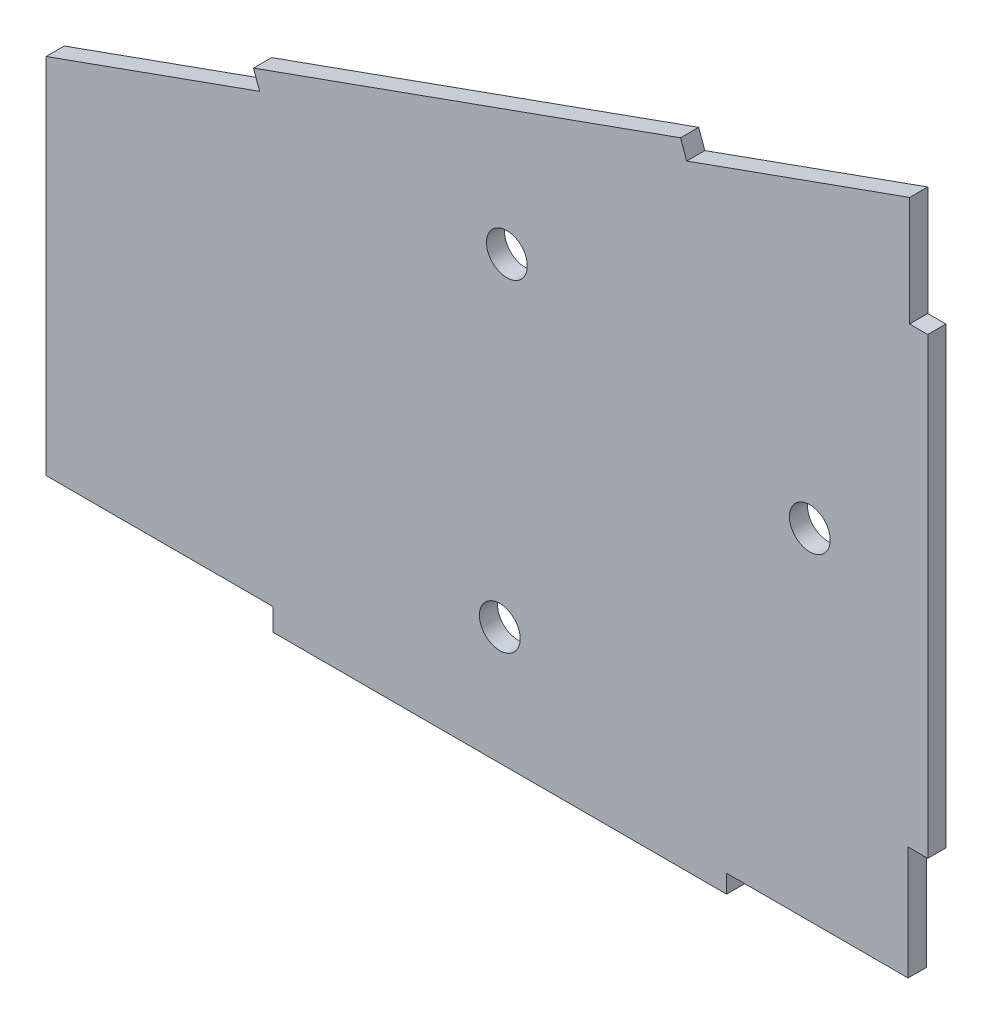
ISO-10303-21;
HEADER;
FILE_DESCRIPTION(('STEP AP214'),'2;1');
FILE_NAME('part.step','',(''),(''),'','','');
FILE_SCHEMA(('AUTOMOTIVE_DESIGN { 1 0 10303 214 1 1 1 1 }'));
ENDSEC;
DATA;
#1=APPLICATION_CONTEXT('core data for automotive mechanical design processes');
#2=APPLICATION_PROTOCOL_DEFINITION('international standard','automotive_design',2000,#1);
#3=PRODUCT_CONTEXT('',#1,'mechanical');
#4=PRODUCT('Part','Part','',(#3));
#5=PRODUCT_RELATED_PRODUCT_CATEGORY('part','',(#4));
#6=PRODUCT_DEFINITION_FORMATION('','',#4);
#7=PRODUCT_DEFINITION_CONTEXT('part definition',#1,'design');
#8=PRODUCT_DEFINITION('design','',#6,#7);
#9=PRODUCT_DEFINITION_SHAPE('','',#8);
#10=(LENGTH_UNIT() NAMED_UNIT(*) SI_UNIT(.MILLI.,.METRE.));
#11=(NAMED_UNIT(*) PLANE_ANGLE_UNIT() SI_UNIT($,.RADIAN.));
#12=(NAMED_UNIT(*) SI_UNIT($,.STERADIAN.) SOLID_ANGLE_UNIT());
#13=UNCERTAINTY_MEASURE_WITH_UNIT(LENGTH_MEASURE(1.E-05),#10,'distance_accuracy_value','');
#14=(GEOMETRIC_REPRESENTATION_CONTEXT(3) GLOBAL_UNCERTAINTY_ASSIGNED_CONTEXT((#13)) GLOBAL_UNIT_ASSIGNED_CONTEXT((#10,
#11,#12)) REPRESENTATION_CONTEXT('',''));
#15=CARTESIAN_POINT('',(0.,0.,0.));
#16=DIRECTION('',(0.,0.,1.));
#17=DIRECTION('',(1.,0.,0.));
#18=AXIS2_PLACEMENT_3D('',#15,#16,#17);
#19=CARTESIAN_POINT('',(-41.4083095907315,11.0698668127962,2.));
#20=DIRECTION('',(0.3375865479723,-0.94129449304038,0.));
#21=DIRECTION('',(0.94129449304038,0.3375865479723,0.));
#22=AXIS2_PLACEMENT_3D('',#19,#20,#21);
#23=PLANE('',#22);
#24=DIRECTION('',(-0.94129449304038,-0.3375865479723,0.));
#25=VECTOR('',#24,1.);
#26=CARTESIAN_POINT('',(-41.4083095907315,11.0698668127962,0.));
#27=LINE('',#26,#25);
#28=CARTESIAN_POINT('',(-41.4083095907315,11.0698668127962,0.));
#29=VERTEX_POINT('',#28);
#30=CARTESIAN_POINT('',(-64.9406719167412,2.63020311348861,0.));
#31=VERTEX_POINT('',#30);
#32=EDGE_CURVE('E190',#29,#31,#27,.T.);
#33=ORIENTED_EDGE('',*,*,#32,.T.);
#34=DIRECTION('',(0.,0.,-1.));
#35=VECTOR('',#34,1.);
#36=CARTESIAN_POINT('',(-64.9406719167412,2.63020311348861,2.));
#37=LINE('',#36,#35);
#38=CARTESIAN_POINT('',(-64.9406719167412,2.63020311348861,2.));
#39=VERTEX_POINT('',#38);
#40=EDGE_CURVE('E11',#39,#31,#37,.T.);
#41=ORIENTED_EDGE('',*,*,#40,.F.);
#42=DIRECTION('',(-0.94129449304038,-0.3375865479723,0.));
#43=VECTOR('',#42,1.);
#44=CARTESIAN_POINT('',(-41.4083095907315,11.0698668127962,2.));
#45=LINE('',#44,#43);
#46=CARTESIAN_POINT('',(-41.4083095907315,11.0698668127962,2.));
#47=VERTEX_POINT('',#46);
#48=EDGE_CURVE('E236',#47,#39,#45,.T.);
#49=ORIENTED_EDGE('',*,*,#48,.F.);
#50=DIRECTION('',(0.,0.,-1.));
#51=VECTOR('',#50,1.);
#52=CARTESIAN_POINT('',(-41.4083095907315,11.0698668127962,2.));
#53=LINE('',#52,#51);
#54=EDGE_CURVE('E186',#47,#29,#53,.T.);
#55=ORIENTED_EDGE('',*,*,#54,.T.);
#56=EDGE_LOOP('',(#33,#41,#49,#55));
#57=FACE_BOUND('',#56,.T.);
#58=ADVANCED_FACE('F39',(#57),#23,.F.);
#59=CARTESIAN_POINT('',(-64.9406719167412,2.63020311348861,2.));
#60=DIRECTION('',(1.,0.,0.));
#61=DIRECTION('',(0.,1.,0.));
#62=AXIS2_PLACEMENT_3D('',#59,#60,#61);
#63=PLANE('',#62);
#64=DIRECTION('',(0.,-1.,0.));
#65=VECTOR('',#64,1.);
#66=CARTESIAN_POINT('',(-64.9406719167412,2.63020311348861,0.));
#67=LINE('',#66,#65);
#68=CARTESIAN_POINT('',(-64.9406719167411,-37.3697968865117,0.));
#69=VERTEX_POINT('',#68);
#70=EDGE_CURVE('E194',#31,#69,#67,.T.);
#71=ORIENTED_EDGE('',*,*,#70,.T.);
#72=DIRECTION('',(0.,0.,-1.));
#73=VECTOR('',#72,1.);
#74=CARTESIAN_POINT('',(-64.9406719167411,-37.3697968865117,2.));
#75=LINE('',#74,#73);
#76=CARTESIAN_POINT('',(-64.9406719167411,-37.3697968865117,2.));
#77=VERTEX_POINT('',#76);
#78=EDGE_CURVE('E49',#77,#69,#75,.T.);
#79=ORIENTED_EDGE('',*,*,#78,.F.);
#80=DIRECTION('',(0.,-1.,0.));
#81=VECTOR('',#80,1.);
#82=CARTESIAN_POINT('',(-64.9406719167412,2.63020311348861,2.));
#83=LINE('',#82,#81);
#84=EDGE_CURVE('E125',#39,#77,#83,.T.);
#85=ORIENTED_EDGE('',*,*,#84,.F.);
#86=ORIENTED_EDGE('',*,*,#40,.T.);
#87=EDGE_LOOP('',(#71,#79,#85,#86));
#88=FACE_BOUND('',#87,.T.);
#89=ADVANCED_FACE('F381',(#88),#63,.F.);
#90=CARTESIAN_POINT('',(-64.9406719167411,-37.3697968865117,2.));
#91=DIRECTION('',(0.,1.,0.));
#92=DIRECTION('',(-1.,0.,0.));
#93=AXIS2_PLACEMENT_3D('',#90,#91,#92);
#94=PLANE('',#93);
#95=DIRECTION('',(1.,0.,0.));
#96=VECTOR('',#95,1.);
#97=CARTESIAN_POINT('',(-64.9406719167411,-37.3697968865117,0.));
#98=LINE('',#97,#96);
#99=CARTESIAN_POINT('',(-39.940671916741,-37.3697968865117,0.));
#100=VERTEX_POINT('',#99);
#101=EDGE_CURVE('E197',#69,#100,#98,.T.);
#102=ORIENTED_EDGE('',*,*,#101,.T.);
#103=DIRECTION('',(0.,0.,-1.));
#104=VECTOR('',#103,1.);
#105=CARTESIAN_POINT('',(-39.940671916741,-37.3697968865117,2.));
#106=LINE('',#105,#104);
#107=CARTESIAN_POINT('',(-39.940671916741,-37.3697968865117,2.));
#108=VERTEX_POINT('',#107);
#109=EDGE_CURVE('E279',#108,#100,#106,.T.);
#110=ORIENTED_EDGE('',*,*,#109,.F.);
#111=DIRECTION('',(1.,0.,0.));
#112=VECTOR('',#111,1.);
#113=CARTESIAN_POINT('',(-64.9406719167411,-37.3697968865117,2.));
#114=LINE('',#113,#112);
#115=EDGE_CURVE('E324',#77,#108,#114,.T.);
#116=ORIENTED_EDGE('',*,*,#115,.F.);
#117=ORIENTED_EDGE('',*,*,#78,.T.);
#118=EDGE_LOOP('',(#102,#110,#116,#117));
#119=FACE_BOUND('',#118,.T.);
#120=ADVANCED_FACE('F385',(#119),#94,.F.);
#121=CARTESIAN_POINT('',(-39.940671916741,-37.3697968865117,2.));
#122=DIRECTION('',(1.,0.,0.));
#123=DIRECTION('',(0.,1.,0.));
#124=AXIS2_PLACEMENT_3D('',#121,#122,#123);
#125=PLANE('',#124);
#126=DIRECTION('',(0.,-1.,0.));
#127=VECTOR('',#126,1.);
#128=CARTESIAN_POINT('',(-39.940671916741,-37.3697968865117,0.));
#129=LINE('',#128,#127);
#130=CARTESIAN_POINT('',(-39.940671916741,-39.8197968865117,0.));
#131=VERTEX_POINT('',#130);
#132=EDGE_CURVE('E200',#100,#131,#129,.T.);
#133=ORIENTED_EDGE('',*,*,#132,.T.);
#134=DIRECTION('',(0.,0.,-1.));
#135=VECTOR('',#134,1.);
#136=CARTESIAN_POINT('',(-39.940671916741,-39.8197968865117,2.));
#137=LINE('',#136,#135);
#138=CARTESIAN_POINT('',(-39.940671916741,-39.8197968865117,2.));
#139=VERTEX_POINT('',#138);
#140=EDGE_CURVE('E275',#139,#131,#137,.T.);
#141=ORIENTED_EDGE('',*,*,#140,.F.);
#142=DIRECTION('',(0.,-1.,0.));
#143=VECTOR('',#142,1.);
#144=CARTESIAN_POINT('',(-39.940671916741,-37.3697968865117,2.));
#145=LINE('',#144,#143);
#146=EDGE_CURVE('E327',#108,#139,#145,.T.);
#147=ORIENTED_EDGE('',*,*,#146,.F.);
#148=ORIENTED_EDGE('',*,*,#109,.T.);
#149=EDGE_LOOP('',(#133,#141,#147,#148));
#150=FACE_BOUND('',#149,.T.);
#151=ADVANCED_FACE('F389',(#150),#125,.F.);
#152=CARTESIAN_POINT('',(-39.940671916741,-39.8197968865117,2.));
#153=DIRECTION('',(0.,1.,0.));
#154=DIRECTION('',(0.,0.,1.));
#155=AXIS2_PLACEMENT_3D('',#152,#153,#154);
#156=PLANE('',#155);
#157=DIRECTION('',(1.,0.,0.));
#158=VECTOR('',#157,1.);
#159=CARTESIAN_POINT('',(-39.940671916741,-39.8197968865117,0.));
#160=LINE('',#159,#158);
#161=CARTESIAN_POINT('',(10.059328083259,-39.8197968865117,0.));
#162=VERTEX_POINT('',#161);
#163=EDGE_CURVE('E203',#131,#162,#160,.T.);
#164=ORIENTED_EDGE('',*,*,#163,.T.);
#165=DIRECTION('',(0.,0.,-1.));
#166=VECTOR('',#165,1.);
#167=CARTESIAN_POINT('',(10.059328083259,-39.8197968865117,2.));
#168=LINE('',#167,#166);
#169=CARTESIAN_POINT('',(10.059328083259,-39.8197968865117,2.));
#170=VERTEX_POINT('',#169);
#171=EDGE_CURVE('E271',#170,#162,#168,.T.);
#172=ORIENTED_EDGE('',*,*,#171,.F.);
#173=DIRECTION('',(1.,0.,0.));
#174=VECTOR('',#173,1.);
#175=CARTESIAN_POINT('',(-39.940671916741,-39.8197968865117,2.));
#176=LINE('',#175,#174);
#177=EDGE_CURVE('E330',#139,#170,#176,.T.);
#178=ORIENTED_EDGE('',*,*,#177,.F.);
#179=ORIENTED_EDGE('',*,*,#140,.T.);
#180=EDGE_LOOP('',(#164,#172,#178,#179));
#181=FACE_BOUND('',#180,.T.);
#182=ADVANCED_FACE('F395',(#181),#156,.F.);
#183=CARTESIAN_POINT('',(10.059328083259,-37.8197968865117,2.));
#184=DIRECTION('',(-1.,0.,0.));
#185=DIRECTION('',(0.,0.,1.));
#186=AXIS2_PLACEMENT_3D('',#183,#184,#185);
#187=PLANE('',#186);
#188=DIRECTION('',(0.,1.,0.));
#189=VECTOR('',#188,1.);
#190=CARTESIAN_POINT('',(10.059328083259,-37.8197968865117,0.));
#191=LINE('',#190,#189);
#192=CARTESIAN_POINT('',(10.059328083259,-37.8197968865117,0.));
#193=VERTEX_POINT('',#192);
#194=EDGE_CURVE('E206',#162,#193,#191,.T.);
#195=ORIENTED_EDGE('',*,*,#194,.T.);
#196=DIRECTION('',(0.,0.,-1.));
#197=VECTOR('',#196,1.);
#198=CARTESIAN_POINT('',(10.059328083259,-37.8197968865117,2.));
#199=LINE('',#198,#197);
#200=CARTESIAN_POINT('',(10.059328083259,-37.8197968865117,2.));
#201=VERTEX_POINT('',#200);
#202=EDGE_CURVE('E267',#201,#193,#199,.T.);
#203=ORIENTED_EDGE('',*,*,#202,.F.);
#204=DIRECTION('',(0.,1.,0.));
#205=VECTOR('',#204,1.);
#206=CARTESIAN_POINT('',(10.059328083259,-37.8197968865117,2.));
#207=LINE('',#206,#205);
#208=EDGE_CURVE('E333',#170,#201,#207,.T.);
#209=ORIENTED_EDGE('',*,*,#208,.F.);
#210=ORIENTED_EDGE('',*,*,#171,.T.);
#211=EDGE_LOOP('',(#195,#203,#209,#210));
#212=FACE_BOUND('',#211,.T.);
#213=ADVANCED_FACE('F399',(#212),#187,.F.);
#214=CARTESIAN_POINT('',(10.059328083259,-37.8197968865117,2.));
#215=DIRECTION('',(0.,1.,0.));
#216=DIRECTION('',(-1.,0.,0.));
#217=AXIS2_PLACEMENT_3D('',#214,#215,#216);
#218=PLANE('',#217);
#219=DIRECTION('',(1.,0.,0.));
#220=VECTOR('',#219,1.);
#221=CARTESIAN_POINT('',(10.059328083259,-37.8197968865117,0.));
#222=LINE('',#221,#220);
#223=CARTESIAN_POINT('',(30.059328083259,-37.8197968865116,0.));
#224=VERTEX_POINT('',#223);
#225=EDGE_CURVE('E209',#193,#224,#222,.T.);
#226=ORIENTED_EDGE('',*,*,#225,.T.);
#227=DIRECTION('',(0.,0.,-1.));
#228=VECTOR('',#227,1.);
#229=CARTESIAN_POINT('',(30.059328083259,-37.8197968865116,2.));
#230=LINE('',#229,#228);
#231=CARTESIAN_POINT('',(30.059328083259,-37.8197968865116,2.));
#232=VERTEX_POINT('',#231);
#233=EDGE_CURVE('E263',#232,#224,#230,.T.);
#234=ORIENTED_EDGE('',*,*,#233,.F.);
#235=DIRECTION('',(1.,0.,0.));
#236=VECTOR('',#235,1.);
#237=CARTESIAN_POINT('',(10.059328083259,-37.8197968865117,2.));
#238=LINE('',#237,#236);
#239=EDGE_CURVE('E336',#201,#232,#238,.T.);
#240=ORIENTED_EDGE('',*,*,#239,.F.);
#241=ORIENTED_EDGE('',*,*,#202,.T.);
#242=EDGE_LOOP('',(#226,#234,#240,#241));
#243=FACE_BOUND('',#242,.T.);
#244=ADVANCED_FACE('F403',(#243),#218,.F.);
#245=CARTESIAN_POINT('',(30.059328083259,-37.8197968865116,2.));
#246=DIRECTION('',(-1.,0.,0.));
#247=DIRECTION('',(0.,-1.,0.));
#248=AXIS2_PLACEMENT_3D('',#245,#246,#247);
#249=PLANE('',#248);
#250=DIRECTION('',(0.,1.,0.));
#251=VECTOR('',#250,1.);
#252=CARTESIAN_POINT('',(30.059328083259,-37.8197968865116,0.));
#253=LINE('',#252,#251);
#254=CARTESIAN_POINT('',(30.059328083259,-25.3197968865116,0.));
#255=VERTEX_POINT('',#254);
#256=EDGE_CURVE('E212',#224,#255,#253,.T.);
#257=ORIENTED_EDGE('',*,*,#256,.T.);
#258=DIRECTION('',(0.,0.,-1.));
#259=VECTOR('',#258,1.);
#260=CARTESIAN_POINT('',(30.059328083259,-25.3197968865116,2.));
#261=LINE('',#260,#259);
#262=CARTESIAN_POINT('',(30.059328083259,-25.3197968865116,2.));
#263=VERTEX_POINT('',#262);
#264=EDGE_CURVE('E259',#263,#255,#261,.T.);
#265=ORIENTED_EDGE('',*,*,#264,.F.);
#266=DIRECTION('',(0.,1.,0.));
#267=VECTOR('',#266,1.);
#268=CARTESIAN_POINT('',(30.059328083259,-37.8197968865116,2.));
#269=LINE('',#268,#267);
#270=EDGE_CURVE('E339',#232,#263,#269,.T.);
#271=ORIENTED_EDGE('',*,*,#270,.F.);
#272=ORIENTED_EDGE('',*,*,#233,.T.);
#273=EDGE_LOOP('',(#257,#265,#271,#272));
#274=FACE_BOUND('',#273,.T.);
#275=ADVANCED_FACE('F407',(#274),#249,.F.);
#276=CARTESIAN_POINT('',(30.059328083259,-25.3197968865116,2.));
#277=DIRECTION('',(0.,1.,0.));
#278=DIRECTION('',(-1.,0.,0.));
#279=AXIS2_PLACEMENT_3D('',#276,#277,#278);
#280=PLANE('',#279);
#281=DIRECTION('',(1.,0.,0.));
#282=VECTOR('',#281,1.);
#283=CARTESIAN_POINT('',(30.059328083259,-25.3197968865116,0.));
#284=LINE('',#283,#282);
#285=CARTESIAN_POINT('',(32.2242013296412,-25.3197968865116,0.));
#286=VERTEX_POINT('',#285);
#287=EDGE_CURVE('E215',#255,#286,#284,.T.);
#288=ORIENTED_EDGE('',*,*,#287,.T.);
#289=DIRECTION('',(0.,0.,-1.));
#290=VECTOR('',#289,1.);
#291=CARTESIAN_POINT('',(32.2242013296412,-25.3197968865116,2.));
#292=LINE('',#291,#290);
#293=CARTESIAN_POINT('',(32.2242013296412,-25.3197968865116,2.));
#294=VERTEX_POINT('',#293);
#295=EDGE_CURVE('E255',#294,#286,#292,.T.);
#296=ORIENTED_EDGE('',*,*,#295,.F.);
#297=DIRECTION('',(1.,0.,0.));
#298=VECTOR('',#297,1.);
#299=CARTESIAN_POINT('',(30.059328083259,-25.3197968865116,2.));
#300=LINE('',#299,#298);
#301=EDGE_CURVE('E342',#263,#294,#300,.T.);
#302=ORIENTED_EDGE('',*,*,#301,.F.);
#303=ORIENTED_EDGE('',*,*,#264,.T.);
#304=EDGE_LOOP('',(#288,#296,#302,#303));
#305=FACE_BOUND('',#304,.T.);
#306=ADVANCED_FACE('F411',(#305),#280,.F.);
#307=CARTESIAN_POINT('',(32.2242013296412,24.6802031134884,2.));
#308=DIRECTION('',(-1.,0.,0.));
#309=DIRECTION('',(0.,-1.,0.));
#310=AXIS2_PLACEMENT_3D('',#307,#308,#309);
#311=PLANE('',#310);
#312=DIRECTION('',(0.,1.,0.));
#313=VECTOR('',#312,1.);
#314=CARTESIAN_POINT('',(32.2242013296412,24.6802031134884,0.));
#315=LINE('',#314,#313);
#316=CARTESIAN_POINT('',(32.2242013296412,24.6802031134884,0.));
#317=VERTEX_POINT('',#316);
#318=EDGE_CURVE('E218',#286,#317,#315,.T.);
#319=ORIENTED_EDGE('',*,*,#318,.T.);
#320=DIRECTION('',(0.,0.,-1.));
#321=VECTOR('',#320,1.);
#322=CARTESIAN_POINT('',(32.2242013296412,24.6802031134884,2.));
#323=LINE('',#322,#321);
#324=CARTESIAN_POINT('',(32.2242013296412,24.6802031134884,2.));
#325=VERTEX_POINT('',#324);
#326=EDGE_CURVE('E251',#325,#317,#323,.T.);
#327=ORIENTED_EDGE('',*,*,#326,.F.);
#328=DIRECTION('',(0.,1.,0.));
#329=VECTOR('',#328,1.);
#330=CARTESIAN_POINT('',(32.2242013296412,24.6802031134884,2.));
#331=LINE('',#330,#329);
#332=EDGE_CURVE('E345',#294,#325,#331,.T.);
#333=ORIENTED_EDGE('',*,*,#332,.F.);
#334=ORIENTED_EDGE('',*,*,#295,.T.);
#335=EDGE_LOOP('',(#319,#327,#333,#334));
#336=FACE_BOUND('',#335,.T.);
#337=ADVANCED_FACE('F415',(#336),#311,.F.);
#338=CARTESIAN_POINT('',(30.2242013296412,24.6802031134884,2.));
#339=DIRECTION('',(0.,-1.,0.));
#340=DIRECTION('',(0.,0.,-1.));
#341=AXIS2_PLACEMENT_3D('',#338,#339,#340);
#342=PLANE('',#341);
#343=DIRECTION('',(-1.,0.,0.));
#344=VECTOR('',#343,1.);
#345=CARTESIAN_POINT('',(30.2242013296412,24.6802031134884,0.));
#346=LINE('',#345,#344);
#347=CARTESIAN_POINT('',(30.2242013296412,24.6802031134884,0.));
#348=VERTEX_POINT('',#347);
#349=EDGE_CURVE('E221',#317,#348,#346,.T.);
#350=ORIENTED_EDGE('',*,*,#349,.T.);
#351=DIRECTION('',(0.,0.,-1.));
#352=VECTOR('',#351,1.);
#353=CARTESIAN_POINT('',(30.2242013296412,24.6802031134884,2.));
#354=LINE('',#353,#352);
#355=CARTESIAN_POINT('',(30.2242013296412,24.6802031134884,2.));
#356=VERTEX_POINT('',#355);
#357=EDGE_CURVE('E247',#356,#348,#354,.T.);
#358=ORIENTED_EDGE('',*,*,#357,.F.);
#359=DIRECTION('',(-1.,0.,0.));
#360=VECTOR('',#359,1.);
#361=CARTESIAN_POINT('',(30.2242013296412,24.6802031134884,2.));
#362=LINE('',#361,#360);
#363=EDGE_CURVE('E348',#325,#356,#362,.T.);
#364=ORIENTED_EDGE('',*,*,#363,.F.);
#365=ORIENTED_EDGE('',*,*,#326,.T.);
#366=EDGE_LOOP('',(#350,#358,#364,#365));
#367=FACE_BOUND('',#366,.T.);
#368=ADVANCED_FACE('F419',(#367),#342,.F.);
#369=CARTESIAN_POINT('',(30.2242013296412,24.6802031134884,2.));
#370=DIRECTION('',(-1.,0.,0.));
#371=DIRECTION('',(0.,0.,1.));
#372=AXIS2_PLACEMENT_3D('',#369,#370,#371);
#373=PLANE('',#372);
#374=DIRECTION('',(0.,1.,0.));
#375=VECTOR('',#374,1.);
#376=CARTESIAN_POINT('',(30.2242013296412,24.6802031134884,0.));
#377=LINE('',#376,#375);
#378=CARTESIAN_POINT('',(30.2242013296412,36.7602031134884,0.));
#379=VERTEX_POINT('',#378);
#380=EDGE_CURVE('E224',#348,#379,#377,.T.);
#381=ORIENTED_EDGE('',*,*,#380,.T.);
#382=DIRECTION('',(0.,0.,-1.));
#383=VECTOR('',#382,1.);
#384=CARTESIAN_POINT('',(30.2242013296412,36.7602031134884,2.));
#385=LINE('',#384,#383);
#386=CARTESIAN_POINT('',(30.2242013296412,36.7602031134884,2.));
#387=VERTEX_POINT('',#386);
#388=EDGE_CURVE('E243',#387,#379,#385,.T.);
#389=ORIENTED_EDGE('',*,*,#388,.F.);
#390=DIRECTION('',(0.,1.,0.));
#391=VECTOR('',#390,1.);
#392=CARTESIAN_POINT('',(30.2242013296412,24.6802031134884,2.));
#393=LINE('',#392,#391);
#394=EDGE_CURVE('E351',#356,#387,#393,.T.);
#395=ORIENTED_EDGE('',*,*,#394,.F.);
#396=ORIENTED_EDGE('',*,*,#357,.T.);
#397=EDGE_LOOP('',(#381,#389,#395,#396));
#398=FACE_BOUND('',#397,.T.);
#399=ADVANCED_FACE('F359',(#398),#373,.F.);
#400=CARTESIAN_POINT('',(30.2242013296412,36.7602031134884,2.));
#401=DIRECTION('',(0.337586547972305,-0.941294493040378,0.));
#402=DIRECTION('',(0.941294493040378,0.337586547972305,0.));
#403=AXIS2_PLACEMENT_3D('',#400,#401,#402);
#404=PLANE('',#403);
#405=DIRECTION('',(-0.941294493040378,-0.337586547972305,0.));
#406=VECTOR('',#405,1.);
#407=CARTESIAN_POINT('',(30.2242013296412,36.7602031134884,0.));
#408=LINE('',#407,#406);
#409=CARTESIAN_POINT('',(5.65641506128749,27.9491942114112,0.));
#410=VERTEX_POINT('',#409);
#411=EDGE_CURVE('E227',#379,#410,#408,.T.);
#412=ORIENTED_EDGE('',*,*,#411,.T.);
#413=DIRECTION('',(0.,0.,-1.));
#414=VECTOR('',#413,1.);
#415=CARTESIAN_POINT('',(5.65641506128749,27.9491942114112,2.));
#416=LINE('',#415,#414);
#417=CARTESIAN_POINT('',(5.65641506128749,27.9491942114112,2.));
#418=VERTEX_POINT('',#417);
#419=EDGE_CURVE('E179',#418,#410,#416,.T.);
#420=ORIENTED_EDGE('',*,*,#419,.F.);
#421=DIRECTION('',(-0.941294493040378,-0.337586547972305,0.));
#422=VECTOR('',#421,1.);
#423=CARTESIAN_POINT('',(30.2242013296412,36.7602031134884,2.));
#424=LINE('',#423,#422);
#425=EDGE_CURVE('E168',#387,#418,#424,.T.);
#426=ORIENTED_EDGE('',*,*,#425,.F.);
#427=ORIENTED_EDGE('',*,*,#388,.T.);
#428=EDGE_LOOP('',(#412,#420,#426,#427));
#429=FACE_BOUND('',#428,.T.);
#430=ADVANCED_FACE('F363',(#429),#404,.F.);
#431=CARTESIAN_POINT('',(5.65641506128749,27.9491942114112,2.));
#432=DIRECTION('',(-0.94129449304039,-0.337586547972273,0.));
#433=DIRECTION('',(0.337586547972273,-0.94129449304039,0.));
#434=AXIS2_PLACEMENT_3D('',#431,#432,#433);
#435=PLANE('',#434);
#436=DIRECTION('',(-0.337586547972273,0.94129449304039,0.));
#437=VECTOR('',#436,1.);
#438=CARTESIAN_POINT('',(5.65641506128749,27.9491942114112,0.));
#439=LINE('',#438,#437);
#440=CARTESIAN_POINT('',(4.98124196534296,29.831783197492,0.));
#441=VERTEX_POINT('',#440);
#442=EDGE_CURVE('E177',#410,#441,#439,.T.);
#443=ORIENTED_EDGE('',*,*,#442,.T.);
#444=DIRECTION('',(0.,0.,-1.));
#445=VECTOR('',#444,1.);
#446=CARTESIAN_POINT('',(4.98124196534296,29.831783197492,2.));
#447=LINE('',#446,#445);
#448=CARTESIAN_POINT('',(4.98124196534296,29.831783197492,2.));
#449=VERTEX_POINT('',#448);
#450=EDGE_CURVE('E174',#449,#441,#447,.T.);
#451=ORIENTED_EDGE('',*,*,#450,.F.);
#452=DIRECTION('',(-0.337586547972273,0.94129449304039,0.));
#453=VECTOR('',#452,1.);
#454=CARTESIAN_POINT('',(5.65641506128749,27.9491942114112,2.));
#455=LINE('',#454,#453);
#456=EDGE_CURVE('E162',#418,#449,#455,.T.);
#457=ORIENTED_EDGE('',*,*,#456,.F.);
#458=ORIENTED_EDGE('',*,*,#419,.T.);
#459=EDGE_LOOP('',(#443,#451,#457,#458));
#460=FACE_BOUND('',#459,.T.);
#461=ADVANCED_FACE('F175',(#460),#435,.F.);
#462=CARTESIAN_POINT('',(-42.0834826866761,12.9524557988769,2.));
#463=DIRECTION('',(0.337586547972301,-0.94129449304038,0.));
#464=DIRECTION('',(0.94129449304038,0.337586547972301,0.));
#465=AXIS2_PLACEMENT_3D('',#462,#463,#464);
#466=PLANE('',#465);
#467=DIRECTION('',(-0.94129449304038,-0.337586547972301,0.));
#468=VECTOR('',#467,1.);
#469=CARTESIAN_POINT('',(-42.0834826866761,12.9524557988769,0.));
#470=LINE('',#469,#468);
#471=CARTESIAN_POINT('',(-42.0834826866761,12.9524557988769,0.));
#472=VERTEX_POINT('',#471);
#473=EDGE_CURVE('E111',#441,#472,#470,.T.);
#474=ORIENTED_EDGE('',*,*,#473,.T.);
#475=DIRECTION('',(0.,0.,-1.));
#476=VECTOR('',#475,1.);
#477=CARTESIAN_POINT('',(-42.0834826866761,12.9524557988769,2.));
#478=LINE('',#477,#476);
#479=CARTESIAN_POINT('',(-42.0834826866761,12.9524557988769,2.));
#480=VERTEX_POINT('',#479);
#481=EDGE_CURVE('E180',#480,#472,#478,.T.);
#482=ORIENTED_EDGE('',*,*,#481,.F.);
#483=DIRECTION('',(-0.94129449304038,-0.337586547972301,0.));
#484=VECTOR('',#483,1.);
#485=CARTESIAN_POINT('',(-42.0834826866761,12.9524557988769,2.));
#486=LINE('',#485,#484);
#487=EDGE_CURVE('E166',#449,#480,#486,.T.);
#488=ORIENTED_EDGE('',*,*,#487,.F.);
#489=ORIENTED_EDGE('',*,*,#450,.T.);
#490=EDGE_LOOP('',(#474,#482,#488,#489));
#491=FACE_BOUND('',#490,.T.);
#492=ADVANCED_FACE('F182',(#491),#466,.F.);
#493=CARTESIAN_POINT('',(-41.4083095907315,11.0698668127962,2.));
#494=DIRECTION('',(0.941294493040382,0.337586547972295,0.));
#495=DIRECTION('',(-0.337586547972295,0.941294493040382,0.));
#496=AXIS2_PLACEMENT_3D('',#493,#494,#495);
#497=PLANE('',#496);
#498=DIRECTION('',(0.337586547972295,-0.941294493040382,0.));
#499=VECTOR('',#498,1.);
#500=CARTESIAN_POINT('',(-41.4083095907315,11.0698668127962,0.));
#501=LINE('',#500,#499);
#502=EDGE_CURVE('E117',#472,#29,#501,.T.);
#503=ORIENTED_EDGE('',*,*,#502,.T.);
#504=ORIENTED_EDGE('',*,*,#54,.F.);
#505=DIRECTION('',(0.337586547972295,-0.941294493040382,0.));
#506=VECTOR('',#505,1.);
#507=CARTESIAN_POINT('',(-41.4083095907315,11.0698668127962,2.));
#508=LINE('',#507,#506);
#509=EDGE_CURVE('E58',#480,#47,#508,.T.);
#510=ORIENTED_EDGE('',*,*,#509,.F.);
#511=ORIENTED_EDGE('',*,*,#481,.T.);
#512=EDGE_LOOP('',(#503,#504,#510,#511));
#513=FACE_BOUND('',#512,.T.);
#514=ADVANCED_FACE('F370',(#513),#497,.F.);
#515=CARTESIAN_POINT('',(0.,0.,2.));
#516=DIRECTION('',(0.,0.,-1.));
#517=DIRECTION('',(-1.,0.,0.));
#518=AXIS2_PLACEMENT_3D('',#515,#516,#517);
#519=PLANE('',#518);
#520=CARTESIAN_POINT('',(-14.1624952370266,9.15529108865952,2.));
#521=DIRECTION('',(0.,0.,1.));
#522=DIRECTION('',(1.,0.,0.));
#523=AXIS2_PLACEMENT_3D('',#520,#521,#522);
#524=CIRCLE('',#523,2.25);
#525=CARTESIAN_POINT('',(-11.9124952370266,9.15529108865952,2.));
#526=VERTEX_POINT('',#525);
#527=EDGE_CURVE('E290',#526,#526,#524,.T.);
#528=ORIENTED_EDGE('',*,*,#527,.F.);
#529=EDGE_LOOP('',(#528));
#530=FACE_BOUND('',#529,.T.);
#531=CARTESIAN_POINT('',(19.2242013296412,-0.319796886511643,2.));
#532=DIRECTION('',(0.,0.,1.));
#533=DIRECTION('',(1.,0.,0.));
#534=AXIS2_PLACEMENT_3D('',#531,#532,#533);
#535=CIRCLE('',#534,2.25);
#536=CARTESIAN_POINT('',(21.4742013296412,-0.319796886511643,2.));
#537=VERTEX_POINT('',#536);
#538=EDGE_CURVE('E310',#537,#537,#535,.T.);
#539=ORIENTED_EDGE('',*,*,#538,.F.);
#540=EDGE_LOOP('',(#539));
#541=FACE_BOUND('',#540,.T.);
#542=CARTESIAN_POINT('',(-14.940671916741,-26.8197968865117,2.));
#543=DIRECTION('',(0.,0.,1.));
#544=DIRECTION('',(1.,0.,0.));
#545=AXIS2_PLACEMENT_3D('',#542,#543,#544);
#546=CIRCLE('',#545,2.25);
#547=CARTESIAN_POINT('',(-12.690671916741,-26.8197968865117,2.));
#548=VERTEX_POINT('',#547);
#549=EDGE_CURVE('E314',#548,#548,#546,.T.);
#550=ORIENTED_EDGE('',*,*,#549,.F.);
#551=EDGE_LOOP('',(#550));
#552=FACE_BOUND('',#551,.T.);
#553=ORIENTED_EDGE('',*,*,#48,.T.);
#554=ORIENTED_EDGE('',*,*,#84,.T.);
#555=ORIENTED_EDGE('',*,*,#115,.T.);
#556=ORIENTED_EDGE('',*,*,#146,.T.);
#557=ORIENTED_EDGE('',*,*,#177,.T.);
#558=ORIENTED_EDGE('',*,*,#208,.T.);
#559=ORIENTED_EDGE('',*,*,#239,.T.);
#560=ORIENTED_EDGE('',*,*,#270,.T.);
#561=ORIENTED_EDGE('',*,*,#301,.T.);
#562=ORIENTED_EDGE('',*,*,#332,.T.);
#563=ORIENTED_EDGE('',*,*,#363,.T.);
#564=ORIENTED_EDGE('',*,*,#394,.T.);
#565=ORIENTED_EDGE('',*,*,#425,.T.);
#566=ORIENTED_EDGE('',*,*,#456,.T.);
#567=ORIENTED_EDGE('',*,*,#487,.T.);
#568=ORIENTED_EDGE('',*,*,#509,.T.);
#569=EDGE_LOOP('',(#553,#554,#555,#556,#557,#558,#559,#560,#561,#562,#563,#564,#565,#566,#567,#568));
#570=FACE_BOUND('',#569,.T.);
#571=ADVANCED_FACE('F164',(#530,#541,#552,#570),#519,.F.);
#572=CARTESIAN_POINT('',(0.,0.,0.));
#573=DIRECTION('',(0.,0.,-1.));
#574=DIRECTION('',(-1.,0.,0.));
#575=AXIS2_PLACEMENT_3D('',#572,#573,#574);
#576=PLANE('',#575);
#577=CARTESIAN_POINT('',(-14.1624952370266,9.15529108865952,0.));
#578=DIRECTION('',(0.,0.,-1.));
#579=DIRECTION('',(-1.,0.,0.));
#580=AXIS2_PLACEMENT_3D('',#577,#578,#579);
#581=CIRCLE('',#580,2.25);
#582=CARTESIAN_POINT('',(-16.4124952370266,9.15529108865952,0.));
#583=VERTEX_POINT('',#582);
#584=EDGE_CURVE('E42',#583,#583,#581,.F.);
#585=ORIENTED_EDGE('',*,*,#584,.T.);
#586=EDGE_LOOP('',(#585));
#587=FACE_BOUND('',#586,.T.);
#588=CARTESIAN_POINT('',(19.2242013296412,-0.319796886511643,0.));
#589=DIRECTION('',(0.,0.,-1.));
#590=DIRECTION('',(-1.,0.,0.));
#591=AXIS2_PLACEMENT_3D('',#588,#589,#590);
#592=CIRCLE('',#591,2.25);
#593=CARTESIAN_POINT('',(16.9742013296412,-0.319796886511643,0.));
#594=VERTEX_POINT('',#593);
#595=EDGE_CURVE('E289',#594,#594,#592,.F.);
#596=ORIENTED_EDGE('',*,*,#595,.T.);
#597=EDGE_LOOP('',(#596));
#598=FACE_BOUND('',#597,.T.);
#599=CARTESIAN_POINT('',(-14.940671916741,-26.8197968865117,0.));
#600=DIRECTION('',(0.,0.,-1.));
#601=DIRECTION('',(-1.,0.,0.));
#602=AXIS2_PLACEMENT_3D('',#599,#600,#601);
#603=CIRCLE('',#602,2.25);
#604=CARTESIAN_POINT('',(-17.190671916741,-26.8197968865117,0.));
#605=VERTEX_POINT('',#604);
#606=EDGE_CURVE('E286',#605,#605,#603,.F.);
#607=ORIENTED_EDGE('',*,*,#606,.T.);
#608=EDGE_LOOP('',(#607));
#609=FACE_BOUND('',#608,.T.);
#610=ORIENTED_EDGE('',*,*,#32,.F.);
#611=ORIENTED_EDGE('',*,*,#502,.F.);
#612=ORIENTED_EDGE('',*,*,#473,.F.);
#613=ORIENTED_EDGE('',*,*,#442,.F.);
#614=ORIENTED_EDGE('',*,*,#411,.F.);
#615=ORIENTED_EDGE('',*,*,#380,.F.);
#616=ORIENTED_EDGE('',*,*,#349,.F.);
#617=ORIENTED_EDGE('',*,*,#318,.F.);
#618=ORIENTED_EDGE('',*,*,#287,.F.);
#619=ORIENTED_EDGE('',*,*,#256,.F.);
#620=ORIENTED_EDGE('',*,*,#225,.F.);
#621=ORIENTED_EDGE('',*,*,#194,.F.);
#622=ORIENTED_EDGE('',*,*,#163,.F.);
#623=ORIENTED_EDGE('',*,*,#132,.F.);
#624=ORIENTED_EDGE('',*,*,#101,.F.);
#625=ORIENTED_EDGE('',*,*,#70,.F.);
#626=EDGE_LOOP('',(#610,#611,#612,#613,#614,#615,#616,#617,#618,#619,#620,#621,#622,#623,#624,#625));
#627=FACE_BOUND('',#626,.T.);
#628=ADVANCED_FACE('F299',(#587,#598,#609,#627),#576,.T.);
#629=CARTESIAN_POINT('',(-14.940671916741,-26.8197968865117,2.));
#630=DIRECTION('',(0.,0.,-1.));
#631=DIRECTION('',(-1.,0.,0.));
#632=AXIS2_PLACEMENT_3D('',#629,#630,#631);
#633=CYLINDRICAL_SURFACE('',#632,2.25);
#634=ORIENTED_EDGE('',*,*,#606,.F.);
#635=EDGE_LOOP('',(#634));
#636=FACE_BOUND('',#635,.T.);
#637=ORIENTED_EDGE('',*,*,#549,.T.);
#638=EDGE_LOOP('',(#637));
#639=FACE_BOUND('',#638,.T.);
#640=ADVANCED_FACE('F456',(#636,#639),#633,.F.);
#641=CARTESIAN_POINT('',(19.2242013296412,-0.319796886511643,2.));
#642=DIRECTION('',(0.,0.,-1.));
#643=DIRECTION('',(-1.,0.,0.));
#644=AXIS2_PLACEMENT_3D('',#641,#642,#643);
#645=CYLINDRICAL_SURFACE('',#644,2.25);
#646=ORIENTED_EDGE('',*,*,#595,.F.);
#647=EDGE_LOOP('',(#646));
#648=FACE_BOUND('',#647,.T.);
#649=ORIENTED_EDGE('',*,*,#538,.T.);
#650=EDGE_LOOP('',(#649));
#651=FACE_BOUND('',#650,.T.);
#652=ADVANCED_FACE('F304',(#648,#651),#645,.F.);
#653=CARTESIAN_POINT('',(-14.1624952370266,9.15529108865952,2.));
#654=DIRECTION('',(0.,0.,-1.));
#655=DIRECTION('',(-1.,0.,0.));
#656=AXIS2_PLACEMENT_3D('',#653,#654,#655);
#657=CYLINDRICAL_SURFACE('',#656,2.25);
#658=ORIENTED_EDGE('',*,*,#584,.F.);
#659=EDGE_LOOP('',(#658));
#660=FACE_BOUND('',#659,.T.);
#661=ORIENTED_EDGE('',*,*,#527,.T.);
#662=EDGE_LOOP('',(#661));
#663=FACE_BOUND('',#662,.T.);
#664=ADVANCED_FACE('F301',(#660,#663),#657,.F.);
#665=CLOSED_SHELL('',(#58,#89,#120,#151,#182,#213,#244,#275,#306,#337,#368,#399,#430,#461,#492,
#514,#571,#628,#640,#652,#664));
#666=MANIFOLD_SOLID_BREP('B2',#665);
#667=ADVANCED_BREP_SHAPE_REPRESENTATION('',(#18,#666),#14);
#668=SHAPE_DEFINITION_REPRESENTATION(#9,#667);
ENDSEC;
END-ISO-10303-21;
